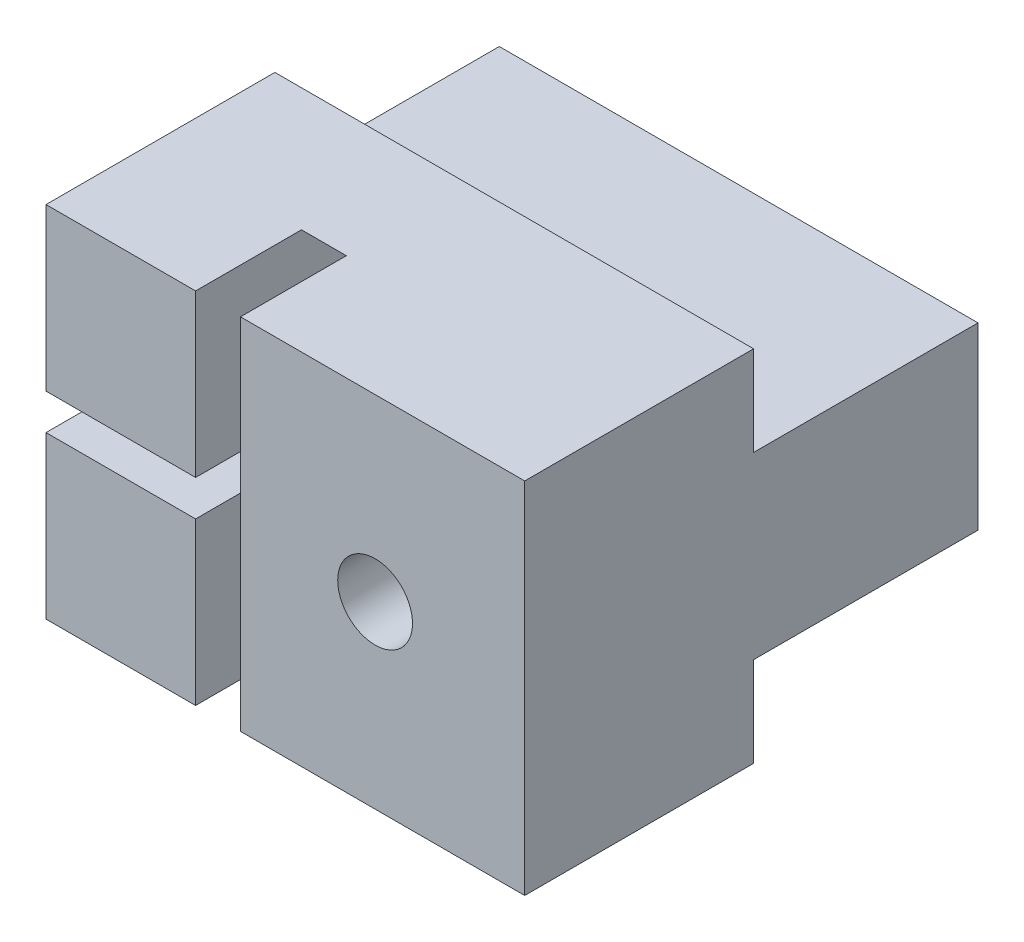
ISO-10303-21;
HEADER;
FILE_DESCRIPTION(('STEP AP214'),'2;1');
FILE_NAME('part.step','',(''),(''),'','','');
FILE_SCHEMA(('AUTOMOTIVE_DESIGN { 1 0 10303 214 1 1 1 1 }'));
ENDSEC;
DATA;
#1=APPLICATION_CONTEXT('core data for automotive mechanical design processes');
#2=APPLICATION_PROTOCOL_DEFINITION('international standard','automotive_design',2000,#1);
#3=PRODUCT_CONTEXT('',#1,'mechanical');
#4=PRODUCT('Part','Part','',(#3));
#5=PRODUCT_RELATED_PRODUCT_CATEGORY('part','',(#4));
#6=PRODUCT_DEFINITION_FORMATION('','',#4);
#7=PRODUCT_DEFINITION_CONTEXT('part definition',#1,'design');
#8=PRODUCT_DEFINITION('design','',#6,#7);
#9=PRODUCT_DEFINITION_SHAPE('','',#8);
#10=(LENGTH_UNIT() NAMED_UNIT(*) SI_UNIT(.MILLI.,.METRE.));
#11=(NAMED_UNIT(*) PLANE_ANGLE_UNIT() SI_UNIT($,.RADIAN.));
#12=(NAMED_UNIT(*) SI_UNIT($,.STERADIAN.) SOLID_ANGLE_UNIT());
#13=UNCERTAINTY_MEASURE_WITH_UNIT(LENGTH_MEASURE(1.E-05),#10,'distance_accuracy_value','');
#14=(GEOMETRIC_REPRESENTATION_CONTEXT(3) GLOBAL_UNCERTAINTY_ASSIGNED_CONTEXT((#13)) GLOBAL_UNIT_ASSIGNED_CONTEXT((#10,
#11,#12)) REPRESENTATION_CONTEXT('',''));
#15=CARTESIAN_POINT('',(0.,0.,0.));
#16=DIRECTION('',(0.,0.,1.));
#17=DIRECTION('',(1.,0.,0.));
#18=AXIS2_PLACEMENT_3D('',#15,#16,#17);
#19=CARTESIAN_POINT('',(0.,0.,0.));
#20=DIRECTION('',(0.,0.,-1.));
#21=DIRECTION('',(-1.,0.,0.));
#22=AXIS2_PLACEMENT_3D('',#19,#20,#21);
#23=PLANE('',#22);
#24=DIRECTION('',(1.,0.,0.));
#25=VECTOR('',#24,1.);
#26=CARTESIAN_POINT('',(-5.59969369608177,28.,0.));
#27=LINE('',#26,#25);
#28=CARTESIAN_POINT('',(-21.5996936960818,28.,0.));
#29=VERTEX_POINT('',#28);
#30=CARTESIAN_POINT('',(-5.59969369608177,28.,0.));
#31=VERTEX_POINT('',#30);
#32=EDGE_CURVE('E181',#29,#31,#27,.T.);
#33=ORIENTED_EDGE('',*,*,#32,.F.);
#34=DIRECTION('',(0.,-1.,0.));
#35=VECTOR('',#34,1.);
#36=CARTESIAN_POINT('',(-21.5996936960818,19.,0.));
#37=LINE('',#36,#35);
#38=CARTESIAN_POINT('',(-21.5996936960818,31.,0.));
#39=VERTEX_POINT('',#38);
#40=EDGE_CURVE('E275',#39,#29,#37,.T.);
#41=ORIENTED_EDGE('',*,*,#40,.F.);
#42=DIRECTION('',(-1.,0.,0.));
#43=VECTOR('',#42,1.);
#44=CARTESIAN_POINT('',(-21.5996936960818,31.,0.));
#45=LINE('',#44,#43);
#46=CARTESIAN_POINT('',(-5.59969369608177,31.,0.));
#47=VERTEX_POINT('',#46);
#48=EDGE_CURVE('E261',#47,#39,#45,.T.);
#49=ORIENTED_EDGE('',*,*,#48,.F.);
#50=DIRECTION('',(0.,1.,0.));
#51=VECTOR('',#50,1.);
#52=CARTESIAN_POINT('',(-5.59969369608177,19.,0.));
#53=LINE('',#52,#51);
#54=EDGE_CURVE('E61',#31,#47,#53,.T.);
#55=ORIENTED_EDGE('',*,*,#54,.F.);
#56=EDGE_LOOP('',(#33,#41,#49,#55));
#57=FACE_BOUND('',#56,.T.);
#58=ADVANCED_FACE('F45',(#57),#23,.T.);
#59=CARTESIAN_POINT('',(-21.5996936960818,19.,27.65));
#60=DIRECTION('',(0.,1.,0.));
#61=DIRECTION('',(0.,0.,1.));
#62=AXIS2_PLACEMENT_3D('',#59,#60,#61);
#63=PLANE('',#62);
#64=DIRECTION('',(0.,0.,1.));
#65=VECTOR('',#64,1.);
#66=CARTESIAN_POINT('',(-15.0996936960818,19.,27.65));
#67=LINE('',#66,#65);
#68=CARTESIAN_POINT('',(-15.0996936960818,19.,4.11123412892984));
#69=VERTEX_POINT('',#68);
#70=CARTESIAN_POINT('',(-15.0996936960818,19.,7.65));
#71=VERTEX_POINT('',#70);
#72=EDGE_CURVE('E216',#69,#71,#67,.T.);
#73=ORIENTED_EDGE('',*,*,#72,.F.);
#74=DIRECTION('',(-1.,0.,0.));
#75=VECTOR('',#74,1.);
#76=CARTESIAN_POINT('',(-15.0996936960818,19.,4.11123412892984));
#77=LINE('',#76,#75);
#78=CARTESIAN_POINT('',(-16.5996936960818,19.,4.11123412892984));
#79=VERTEX_POINT('',#78);
#80=EDGE_CURVE('E219',#69,#79,#77,.T.);
#81=ORIENTED_EDGE('',*,*,#80,.T.);
#82=DIRECTION('',(0.,0.,1.));
#83=VECTOR('',#82,1.);
#84=CARTESIAN_POINT('',(-16.5996936960818,19.,27.65));
#85=LINE('',#84,#83);
#86=CARTESIAN_POINT('',(-16.5996936960818,19.,7.65));
#87=VERTEX_POINT('',#86);
#88=EDGE_CURVE('E204',#79,#87,#85,.T.);
#89=ORIENTED_EDGE('',*,*,#88,.T.);
#90=DIRECTION('',(1.,0.,0.));
#91=VECTOR('',#90,1.);
#92=CARTESIAN_POINT('',(-21.5996936960818,19.,7.65));
#93=LINE('',#92,#91);
#94=CARTESIAN_POINT('',(-21.5996936960818,19.,7.65));
#95=VERTEX_POINT('',#94);
#96=EDGE_CURVE('E284',#95,#87,#93,.T.);
#97=ORIENTED_EDGE('',*,*,#96,.F.);
#98=DIRECTION('',(0.,0.,-1.));
#99=VECTOR('',#98,1.);
#100=CARTESIAN_POINT('',(-21.5996936960818,19.,27.65));
#101=LINE('',#100,#99);
#102=CARTESIAN_POINT('',(-21.5996936960818,19.,0.));
#103=VERTEX_POINT('',#102);
#104=EDGE_CURVE('E274',#95,#103,#101,.T.);
#105=ORIENTED_EDGE('',*,*,#104,.T.);
#106=DIRECTION('',(1.,0.,0.));
#107=VECTOR('',#106,1.);
#108=CARTESIAN_POINT('',(-21.5996936960818,19.,0.));
#109=LINE('',#108,#107);
#110=CARTESIAN_POINT('',(-5.59969369608177,19.,0.));
#111=VERTEX_POINT('',#110);
#112=EDGE_CURVE('E269',#103,#111,#109,.T.);
#113=ORIENTED_EDGE('',*,*,#112,.T.);
#114=DIRECTION('',(0.,0.,-1.));
#115=VECTOR('',#114,1.);
#116=CARTESIAN_POINT('',(-5.59969369608177,19.,27.65));
#117=LINE('',#116,#115);
#118=CARTESIAN_POINT('',(-5.59969369608177,19.,7.65));
#119=VERTEX_POINT('',#118);
#120=EDGE_CURVE('E273',#119,#111,#117,.T.);
#121=ORIENTED_EDGE('',*,*,#120,.F.);
#122=EDGE_CURVE('E288',#71,#119,#93,.T.);
#123=ORIENTED_EDGE('',*,*,#122,.F.);
#124=EDGE_LOOP('',(#73,#81,#89,#97,#105,#113,#121,#123));
#125=FACE_BOUND('',#124,.T.);
#126=ADVANCED_FACE('F318',(#125),#63,.F.);
#127=CARTESIAN_POINT('',(-21.5996936960818,31.,27.65));
#128=DIRECTION('',(0.,-1.,0.));
#129=DIRECTION('',(0.,0.,-1.));
#130=AXIS2_PLACEMENT_3D('',#127,#128,#129);
#131=PLANE('',#130);
#132=DIRECTION('',(0.,0.,-1.));
#133=VECTOR('',#132,1.);
#134=CARTESIAN_POINT('',(-15.0996936960818,31.,27.65));
#135=LINE('',#134,#133);
#136=CARTESIAN_POINT('',(-15.0996936960818,31.,7.65));
#137=VERTEX_POINT('',#136);
#138=CARTESIAN_POINT('',(-15.0996936960818,31.,4.11123412892984));
#139=VERTEX_POINT('',#138);
#140=EDGE_CURVE('E213',#137,#139,#135,.T.);
#141=ORIENTED_EDGE('',*,*,#140,.F.);
#142=DIRECTION('',(-1.,0.,0.));
#143=VECTOR('',#142,1.);
#144=CARTESIAN_POINT('',(-21.5996936960818,31.,7.65));
#145=LINE('',#144,#143);
#146=CARTESIAN_POINT('',(-5.59969369608177,31.,7.65));
#147=VERTEX_POINT('',#146);
#148=EDGE_CURVE('E294',#147,#137,#145,.T.);
#149=ORIENTED_EDGE('',*,*,#148,.F.);
#150=DIRECTION('',(0.,0.,-1.));
#151=VECTOR('',#150,1.);
#152=CARTESIAN_POINT('',(-5.59969369608177,31.,27.65));
#153=LINE('',#152,#151);
#154=EDGE_CURVE('E266',#147,#47,#153,.T.);
#155=ORIENTED_EDGE('',*,*,#154,.T.);
#156=ORIENTED_EDGE('',*,*,#48,.T.);
#157=DIRECTION('',(0.,0.,-1.));
#158=VECTOR('',#157,1.);
#159=CARTESIAN_POINT('',(-21.5996936960818,31.,27.65));
#160=LINE('',#159,#158);
#161=CARTESIAN_POINT('',(-21.5996936960818,31.,7.65));
#162=VERTEX_POINT('',#161);
#163=EDGE_CURVE('E251',#162,#39,#160,.T.);
#164=ORIENTED_EDGE('',*,*,#163,.F.);
#165=CARTESIAN_POINT('',(-16.5996936960818,31.,7.65));
#166=VERTEX_POINT('',#165);
#167=EDGE_CURVE('E265',#166,#162,#145,.T.);
#168=ORIENTED_EDGE('',*,*,#167,.F.);
#169=DIRECTION('',(0.,0.,-1.));
#170=VECTOR('',#169,1.);
#171=CARTESIAN_POINT('',(-16.5996936960818,31.,27.65));
#172=LINE('',#171,#170);
#173=CARTESIAN_POINT('',(-16.5996936960818,31.,4.11123412892984));
#174=VERTEX_POINT('',#173);
#175=EDGE_CURVE('E209',#166,#174,#172,.T.);
#176=ORIENTED_EDGE('',*,*,#175,.T.);
#177=DIRECTION('',(-1.,0.,0.));
#178=VECTOR('',#177,1.);
#179=CARTESIAN_POINT('',(-15.0996936960818,31.,4.11123412892984));
#180=LINE('',#179,#178);
#181=EDGE_CURVE('E11',#174,#139,#180,.F.);
#182=ORIENTED_EDGE('',*,*,#181,.T.);
#183=EDGE_LOOP('',(#141,#149,#155,#156,#164,#168,#176,#182));
#184=FACE_BOUND('',#183,.T.);
#185=ADVANCED_FACE('F373',(#184),#131,.F.);
#186=CARTESIAN_POINT('',(-94.7383382518,25.35,7.65));
#187=DIRECTION('',(0.,0.,1.));
#188=DIRECTION('',(0.,1.,0.));
#189=AXIS2_PLACEMENT_3D('',#186,#187,#188);
#190=PLANE('',#189);
#191=CARTESIAN_POINT('',(-10.5996936960818,25.,7.65));
#192=DIRECTION('',(0.,0.,-1.));
#193=DIRECTION('',(-1.,0.,0.));
#194=AXIS2_PLACEMENT_3D('',#191,#192,#193);
#195=CIRCLE('',#194,1.25);
#196=CARTESIAN_POINT('',(-11.8496936960818,25.,7.65));
#197=VERTEX_POINT('',#196);
#198=EDGE_CURVE('E406',#197,#197,#195,.T.);
#199=ORIENTED_EDGE('',*,*,#198,.T.);
#200=EDGE_LOOP('',(#199));
#201=FACE_BOUND('',#200,.T.);
#202=ORIENTED_EDGE('',*,*,#148,.T.);
#203=DIRECTION('',(0.,-1.,0.));
#204=VECTOR('',#203,1.);
#205=CARTESIAN_POINT('',(-15.0996936960818,25.35,7.65));
#206=LINE('',#205,#204);
#207=EDGE_CURVE('E54',#137,#71,#206,.T.);
#208=ORIENTED_EDGE('',*,*,#207,.T.);
#209=ORIENTED_EDGE('',*,*,#122,.T.);
#210=DIRECTION('',(0.,1.,0.));
#211=VECTOR('',#210,1.);
#212=CARTESIAN_POINT('',(-5.59969369608177,19.,7.65));
#213=LINE('',#212,#211);
#214=EDGE_CURVE('E280',#119,#147,#213,.T.);
#215=ORIENTED_EDGE('',*,*,#214,.T.);
#216=EDGE_LOOP('',(#202,#208,#209,#215));
#217=FACE_BOUND('',#216,.T.);
#218=ADVANCED_FACE('F311',(#201,#217),#190,.T.);
#219=DIRECTION('',(0.,-1.,0.));
#220=VECTOR('',#219,1.);
#221=CARTESIAN_POINT('',(-16.5996936960818,25.35,7.65));
#222=LINE('',#221,#220);
#223=CARTESIAN_POINT('',(-16.5996936960818,25.6,7.65));
#224=VERTEX_POINT('',#223);
#225=EDGE_CURVE('E205',#166,#224,#222,.T.);
#226=ORIENTED_EDGE('',*,*,#225,.F.);
#227=ORIENTED_EDGE('',*,*,#167,.T.);
#228=DIRECTION('',(0.,-1.,0.));
#229=VECTOR('',#228,1.);
#230=CARTESIAN_POINT('',(-21.5996936960818,19.,7.65));
#231=LINE('',#230,#229);
#232=CARTESIAN_POINT('',(-21.5996936960818,25.6,7.65));
#233=VERTEX_POINT('',#232);
#234=EDGE_CURVE('E289',#162,#233,#231,.T.);
#235=ORIENTED_EDGE('',*,*,#234,.T.);
#236=DIRECTION('',(-1.,0.,0.));
#237=VECTOR('',#236,1.);
#238=CARTESIAN_POINT('',(-21.5996936960818,25.6,7.65));
#239=LINE('',#238,#237);
#240=EDGE_CURVE('E229',#224,#233,#239,.T.);
#241=ORIENTED_EDGE('',*,*,#240,.F.);
#242=EDGE_LOOP('',(#226,#227,#235,#241));
#243=FACE_BOUND('',#242,.T.);
#244=ADVANCED_FACE('F335',(#243),#190,.T.);
#245=CARTESIAN_POINT('',(-21.5996936960818,19.,27.65));
#246=DIRECTION('',(1.,0.,0.));
#247=DIRECTION('',(0.,0.,-1.));
#248=AXIS2_PLACEMENT_3D('',#245,#246,#247);
#249=PLANE('',#248);
#250=DIRECTION('',(0.,-1.,0.));
#251=VECTOR('',#250,1.);
#252=CARTESIAN_POINT('',(-21.5996936960818,25.6,3.15));
#253=LINE('',#252,#251);
#254=CARTESIAN_POINT('',(-21.5996936960818,25.6,3.15));
#255=VERTEX_POINT('',#254);
#256=CARTESIAN_POINT('',(-21.5996936960818,24.4,3.15));
#257=VERTEX_POINT('',#256);
#258=EDGE_CURVE('E224',#255,#257,#253,.T.);
#259=ORIENTED_EDGE('',*,*,#258,.F.);
#260=DIRECTION('',(0.,0.,1.));
#261=VECTOR('',#260,1.);
#262=CARTESIAN_POINT('',(-21.5996936960818,25.6,3.15));
#263=LINE('',#262,#261);
#264=EDGE_CURVE('E247',#255,#233,#263,.T.);
#265=ORIENTED_EDGE('',*,*,#264,.T.);
#266=ORIENTED_EDGE('',*,*,#234,.F.);
#267=ORIENTED_EDGE('',*,*,#163,.T.);
#268=ORIENTED_EDGE('',*,*,#40,.T.);
#269=DIRECTION('',(0.,0.,1.));
#270=VECTOR('',#269,1.);
#271=CARTESIAN_POINT('',(-21.5996936960818,28.,-7.5));
#272=LINE('',#271,#270);
#273=CARTESIAN_POINT('',(-21.5996936960818,28.,-7.5));
#274=VERTEX_POINT('',#273);
#275=EDGE_CURVE('E194',#274,#29,#272,.T.);
#276=ORIENTED_EDGE('',*,*,#275,.F.);
#277=DIRECTION('',(0.,1.,0.));
#278=VECTOR('',#277,1.);
#279=CARTESIAN_POINT('',(-21.5996936960818,28.,-7.5));
#280=LINE('',#279,#278);
#281=CARTESIAN_POINT('',(-21.5996936960818,22.,-7.5));
#282=VERTEX_POINT('',#281);
#283=EDGE_CURVE('E170',#282,#274,#280,.T.);
#284=ORIENTED_EDGE('',*,*,#283,.F.);
#285=DIRECTION('',(0.,0.,1.));
#286=VECTOR('',#285,1.);
#287=CARTESIAN_POINT('',(-21.5996936960818,22.,-7.5));
#288=LINE('',#287,#286);
#289=CARTESIAN_POINT('',(-21.5996936960818,22.,0.));
#290=VERTEX_POINT('',#289);
#291=EDGE_CURVE('E166',#282,#290,#288,.T.);
#292=ORIENTED_EDGE('',*,*,#291,.T.);
#293=EDGE_CURVE('E279',#290,#103,#37,.T.);
#294=ORIENTED_EDGE('',*,*,#293,.T.);
#295=ORIENTED_EDGE('',*,*,#104,.F.);
#296=CARTESIAN_POINT('',(-21.5996936960818,24.4,7.65));
#297=VERTEX_POINT('',#296);
#298=EDGE_CURVE('E293',#297,#95,#231,.T.);
#299=ORIENTED_EDGE('',*,*,#298,.F.);
#300=DIRECTION('',(0.,0.,1.));
#301=VECTOR('',#300,1.);
#302=CARTESIAN_POINT('',(-21.5996936960818,24.4,3.15));
#303=LINE('',#302,#301);
#304=EDGE_CURVE('E241',#257,#297,#303,.T.);
#305=ORIENTED_EDGE('',*,*,#304,.F.);
#306=EDGE_LOOP('',(#259,#265,#266,#267,#268,#276,#284,#292,#294,#295,#299,#305));
#307=FACE_BOUND('',#306,.T.);
#308=ADVANCED_FACE('F340',(#307),#249,.F.);
#309=CARTESIAN_POINT('',(-5.59969369608177,19.,27.65));
#310=DIRECTION('',(-1.,0.,0.));
#311=DIRECTION('',(0.,0.,1.));
#312=AXIS2_PLACEMENT_3D('',#309,#310,#311);
#313=PLANE('',#312);
#314=ORIENTED_EDGE('',*,*,#214,.F.);
#315=ORIENTED_EDGE('',*,*,#120,.T.);
#316=CARTESIAN_POINT('',(-5.59969369608177,22.,0.));
#317=VERTEX_POINT('',#316);
#318=EDGE_CURVE('E185',#111,#317,#53,.T.);
#319=ORIENTED_EDGE('',*,*,#318,.T.);
#320=DIRECTION('',(0.,0.,1.));
#321=VECTOR('',#320,1.);
#322=CARTESIAN_POINT('',(-5.59969369608178,22.,-7.5));
#323=LINE('',#322,#321);
#324=CARTESIAN_POINT('',(-5.59969369608178,22.,-7.5));
#325=VERTEX_POINT('',#324);
#326=EDGE_CURVE('E164',#325,#317,#323,.T.);
#327=ORIENTED_EDGE('',*,*,#326,.F.);
#328=DIRECTION('',(0.,-1.,0.));
#329=VECTOR('',#328,1.);
#330=CARTESIAN_POINT('',(-5.59969369608177,28.,-7.5));
#331=LINE('',#330,#329);
#332=CARTESIAN_POINT('',(-5.59969369608177,28.,-7.5));
#333=VERTEX_POINT('',#332);
#334=EDGE_CURVE('E171',#333,#325,#331,.T.);
#335=ORIENTED_EDGE('',*,*,#334,.F.);
#336=DIRECTION('',(0.,0.,1.));
#337=VECTOR('',#336,1.);
#338=CARTESIAN_POINT('',(-5.59969369608177,28.,-7.5));
#339=LINE('',#338,#337);
#340=EDGE_CURVE('E363',#333,#31,#339,.T.);
#341=ORIENTED_EDGE('',*,*,#340,.T.);
#342=ORIENTED_EDGE('',*,*,#54,.T.);
#343=ORIENTED_EDGE('',*,*,#154,.F.);
#344=EDGE_LOOP('',(#314,#315,#319,#327,#335,#341,#342,#343));
#345=FACE_BOUND('',#344,.T.);
#346=ADVANCED_FACE('F184',(#345),#313,.F.);
#347=DIRECTION('',(-1.,0.,0.));
#348=VECTOR('',#347,1.);
#349=CARTESIAN_POINT('',(-5.59969369608178,22.,0.));
#350=LINE('',#349,#348);
#351=EDGE_CURVE('E69',#317,#290,#350,.T.);
#352=ORIENTED_EDGE('',*,*,#351,.F.);
#353=ORIENTED_EDGE('',*,*,#318,.F.);
#354=ORIENTED_EDGE('',*,*,#112,.F.);
#355=ORIENTED_EDGE('',*,*,#293,.F.);
#356=EDGE_LOOP('',(#352,#353,#354,#355));
#357=FACE_BOUND('',#356,.T.);
#358=ADVANCED_FACE('F354',(#357),#23,.T.);
#359=CARTESIAN_POINT('',(-16.5996936960818,24.4,7.65));
#360=VERTEX_POINT('',#359);
#361=EDGE_CURVE('E200',#360,#87,#222,.T.);
#362=ORIENTED_EDGE('',*,*,#361,.F.);
#363=DIRECTION('',(1.,0.,0.));
#364=VECTOR('',#363,1.);
#365=CARTESIAN_POINT('',(-21.5996936960818,24.4,7.65));
#366=LINE('',#365,#364);
#367=EDGE_CURVE('E223',#297,#360,#366,.T.);
#368=ORIENTED_EDGE('',*,*,#367,.F.);
#369=ORIENTED_EDGE('',*,*,#298,.T.);
#370=ORIENTED_EDGE('',*,*,#96,.T.);
#371=EDGE_LOOP('',(#362,#368,#369,#370));
#372=FACE_BOUND('',#371,.T.);
#373=ADVANCED_FACE('F47',(#372),#190,.T.);
#374=CARTESIAN_POINT('',(-21.5996936960818,25.6,3.15));
#375=DIRECTION('',(0.,1.,0.));
#376=DIRECTION('',(0.,0.,1.));
#377=AXIS2_PLACEMENT_3D('',#374,#375,#376);
#378=PLANE('',#377);
#379=ORIENTED_EDGE('',*,*,#240,.T.);
#380=ORIENTED_EDGE('',*,*,#264,.F.);
#381=DIRECTION('',(-1.,0.,0.));
#382=VECTOR('',#381,1.);
#383=CARTESIAN_POINT('',(-21.5996936960818,25.6,3.15));
#384=LINE('',#383,#382);
#385=CARTESIAN_POINT('',(-16.5996936960818,25.6,3.15));
#386=VERTEX_POINT('',#385);
#387=EDGE_CURVE('E237',#386,#255,#384,.T.);
#388=ORIENTED_EDGE('',*,*,#387,.F.);
#389=DIRECTION('',(0.,0.,1.));
#390=VECTOR('',#389,1.);
#391=CARTESIAN_POINT('',(-16.5996936960818,25.6,3.15));
#392=LINE('',#391,#390);
#393=EDGE_CURVE('E252',#386,#224,#392,.T.);
#394=ORIENTED_EDGE('',*,*,#393,.T.);
#395=EDGE_LOOP('',(#379,#380,#388,#394));
#396=FACE_BOUND('',#395,.T.);
#397=ADVANCED_FACE('F334',(#396),#378,.F.);
#398=CARTESIAN_POINT('',(-21.5996936960818,24.4,3.15));
#399=DIRECTION('',(0.,-1.,0.));
#400=DIRECTION('',(0.,0.,-1.));
#401=AXIS2_PLACEMENT_3D('',#398,#399,#400);
#402=PLANE('',#401);
#403=ORIENTED_EDGE('',*,*,#367,.T.);
#404=DIRECTION('',(0.,0.,1.));
#405=VECTOR('',#404,1.);
#406=CARTESIAN_POINT('',(-16.5996936960818,24.4,3.15));
#407=LINE('',#406,#405);
#408=CARTESIAN_POINT('',(-16.5996936960818,24.4,3.15));
#409=VERTEX_POINT('',#408);
#410=EDGE_CURVE('E256',#409,#360,#407,.T.);
#411=ORIENTED_EDGE('',*,*,#410,.F.);
#412=DIRECTION('',(1.,0.,0.));
#413=VECTOR('',#412,1.);
#414=CARTESIAN_POINT('',(-21.5996936960818,24.4,3.15));
#415=LINE('',#414,#413);
#416=EDGE_CURVE('E228',#257,#409,#415,.T.);
#417=ORIENTED_EDGE('',*,*,#416,.F.);
#418=ORIENTED_EDGE('',*,*,#304,.T.);
#419=EDGE_LOOP('',(#403,#411,#417,#418));
#420=FACE_BOUND('',#419,.T.);
#421=ADVANCED_FACE('F347',(#420),#402,.F.);
#422=CARTESIAN_POINT('',(0.,0.,3.15));
#423=DIRECTION('',(0.,0.,1.));
#424=DIRECTION('',(1.,0.,0.));
#425=AXIS2_PLACEMENT_3D('',#422,#423,#424);
#426=PLANE('',#425);
#427=ORIENTED_EDGE('',*,*,#258,.T.);
#428=ORIENTED_EDGE('',*,*,#416,.T.);
#429=DIRECTION('',(0.,1.,0.));
#430=VECTOR('',#429,1.);
#431=CARTESIAN_POINT('',(-16.5996936960818,25.6,3.15));
#432=LINE('',#431,#430);
#433=EDGE_CURVE('E233',#409,#386,#432,.T.);
#434=ORIENTED_EDGE('',*,*,#433,.T.);
#435=ORIENTED_EDGE('',*,*,#387,.T.);
#436=EDGE_LOOP('',(#427,#428,#434,#435));
#437=FACE_BOUND('',#436,.T.);
#438=ADVANCED_FACE('F343',(#437),#426,.T.);
#439=CARTESIAN_POINT('',(-15.0996936960818,25.,8.));
#440=DIRECTION('',(-1.,0.,0.));
#441=DIRECTION('',(0.,0.,1.));
#442=AXIS2_PLACEMENT_3D('',#439,#440,#441);
#443=CYLINDRICAL_SURFACE('',#442,7.15);
#444=CARTESIAN_POINT('',(-15.0996936960818,25.,8.));
#445=DIRECTION('',(-1.,0.,0.));
#446=DIRECTION('',(0.,0.,1.));
#447=AXIS2_PLACEMENT_3D('',#444,#445,#446);
#448=CIRCLE('',#447,7.15);
#449=EDGE_CURVE('E192',#139,#69,#448,.T.);
#450=ORIENTED_EDGE('',*,*,#449,.F.);
#451=ORIENTED_EDGE('',*,*,#181,.F.);
#452=CARTESIAN_POINT('',(-16.5996936960818,25.,8.));
#453=DIRECTION('',(-1.,0.,0.));
#454=DIRECTION('',(0.,0.,1.));
#455=AXIS2_PLACEMENT_3D('',#452,#453,#454);
#456=CIRCLE('',#455,7.15);
#457=EDGE_CURVE('E187',#174,#79,#456,.T.);
#458=ORIENTED_EDGE('',*,*,#457,.T.);
#459=ORIENTED_EDGE('',*,*,#80,.F.);
#460=EDGE_LOOP('',(#450,#451,#458,#459));
#461=FACE_BOUND('',#460,.T.);
#462=ADVANCED_FACE('F446',(#461),#443,.F.);
#463=CARTESIAN_POINT('',(-15.0996936960818,25.,8.));
#464=DIRECTION('',(-1.,0.,0.));
#465=DIRECTION('',(0.,0.,1.));
#466=AXIS2_PLACEMENT_3D('',#463,#464,#465);
#467=PLANE('',#466);
#468=ORIENTED_EDGE('',*,*,#72,.T.);
#469=ORIENTED_EDGE('',*,*,#207,.F.);
#470=ORIENTED_EDGE('',*,*,#140,.T.);
#471=ORIENTED_EDGE('',*,*,#449,.T.);
#472=EDGE_LOOP('',(#468,#469,#470,#471));
#473=FACE_BOUND('',#472,.T.);
#474=ADVANCED_FACE('F443',(#473),#467,.T.);
#475=CARTESIAN_POINT('',(-16.5996936960818,25.,8.));
#476=DIRECTION('',(-1.,0.,0.));
#477=DIRECTION('',(0.,0.,1.));
#478=AXIS2_PLACEMENT_3D('',#475,#476,#477);
#479=PLANE('',#478);
#480=ORIENTED_EDGE('',*,*,#225,.T.);
#481=ORIENTED_EDGE('',*,*,#393,.F.);
#482=ORIENTED_EDGE('',*,*,#433,.F.);
#483=ORIENTED_EDGE('',*,*,#410,.T.);
#484=ORIENTED_EDGE('',*,*,#361,.T.);
#485=ORIENTED_EDGE('',*,*,#88,.F.);
#486=ORIENTED_EDGE('',*,*,#457,.F.);
#487=ORIENTED_EDGE('',*,*,#175,.F.);
#488=EDGE_LOOP('',(#480,#481,#482,#483,#484,#485,#486,#487));
#489=FACE_BOUND('',#488,.T.);
#490=ADVANCED_FACE('F327',(#489),#479,.F.);
#491=CARTESIAN_POINT('',(-5.59969369608178,22.,-7.5));
#492=DIRECTION('',(0.,1.,0.));
#493=DIRECTION('',(0.,0.,1.));
#494=AXIS2_PLACEMENT_3D('',#491,#492,#493);
#495=PLANE('',#494);
#496=ORIENTED_EDGE('',*,*,#351,.T.);
#497=ORIENTED_EDGE('',*,*,#291,.F.);
#498=DIRECTION('',(-1.,0.,0.));
#499=VECTOR('',#498,1.);
#500=CARTESIAN_POINT('',(-5.59969369608178,22.,-7.5));
#501=LINE('',#500,#499);
#502=EDGE_CURVE('E160',#325,#282,#501,.T.);
#503=ORIENTED_EDGE('',*,*,#502,.F.);
#504=ORIENTED_EDGE('',*,*,#326,.T.);
#505=EDGE_LOOP('',(#496,#497,#503,#504));
#506=FACE_BOUND('',#505,.T.);
#507=ADVANCED_FACE('F162',(#506),#495,.F.);
#508=CARTESIAN_POINT('',(-5.59969369608177,28.,-7.5));
#509=DIRECTION('',(0.,-1.,0.));
#510=DIRECTION('',(0.,0.,-1.));
#511=AXIS2_PLACEMENT_3D('',#508,#509,#510);
#512=PLANE('',#511);
#513=ORIENTED_EDGE('',*,*,#32,.T.);
#514=ORIENTED_EDGE('',*,*,#340,.F.);
#515=DIRECTION('',(1.,0.,0.));
#516=VECTOR('',#515,1.);
#517=CARTESIAN_POINT('',(-5.59969369608177,28.,-7.5));
#518=LINE('',#517,#516);
#519=EDGE_CURVE('E176',#274,#333,#518,.T.);
#520=ORIENTED_EDGE('',*,*,#519,.F.);
#521=ORIENTED_EDGE('',*,*,#275,.T.);
#522=EDGE_LOOP('',(#513,#514,#520,#521));
#523=FACE_BOUND('',#522,.T.);
#524=ADVANCED_FACE('F371',(#523),#512,.F.);
#525=CARTESIAN_POINT('',(0.,0.,-7.5));
#526=DIRECTION('',(0.,0.,-1.));
#527=DIRECTION('',(-1.,0.,0.));
#528=AXIS2_PLACEMENT_3D('',#525,#526,#527);
#529=PLANE('',#528);
#530=CARTESIAN_POINT('',(-10.5996936960818,25.,-7.5));
#531=DIRECTION('',(0.,0.,-1.));
#532=DIRECTION('',(-1.,0.,0.));
#533=AXIS2_PLACEMENT_3D('',#530,#531,#532);
#534=CIRCLE('',#533,2.25);
#535=CARTESIAN_POINT('',(-12.8496936960818,25.,-7.5));
#536=VERTEX_POINT('',#535);
#537=EDGE_CURVE('E409',#536,#536,#534,.T.);
#538=ORIENTED_EDGE('',*,*,#537,.F.);
#539=EDGE_LOOP('',(#538));
#540=FACE_BOUND('',#539,.T.);
#541=ORIENTED_EDGE('',*,*,#334,.T.);
#542=ORIENTED_EDGE('',*,*,#502,.T.);
#543=ORIENTED_EDGE('',*,*,#283,.T.);
#544=ORIENTED_EDGE('',*,*,#519,.T.);
#545=EDGE_LOOP('',(#541,#542,#543,#544));
#546=FACE_BOUND('',#545,.T.);
#547=ADVANCED_FACE('F174',(#540,#546),#529,.T.);
#548=CARTESIAN_POINT('',(-10.5996936960818,25.,6.36396103067893));
#549=DIRECTION('',(0.,0.,-1.));
#550=DIRECTION('',(-1.,0.,0.));
#551=AXIS2_PLACEMENT_3D('',#548,#549,#550);
#552=CYLINDRICAL_SURFACE('',#551,2.25);
#553=CARTESIAN_POINT('',(-10.5996936960818,25.,0.));
#554=DIRECTION('',(0.,0.,-1.));
#555=DIRECTION('',(-1.,0.,0.));
#556=AXIS2_PLACEMENT_3D('',#553,#554,#555);
#557=CIRCLE('',#556,2.25);
#558=CARTESIAN_POINT('',(-12.8496936960818,25.,0.));
#559=VERTEX_POINT('',#558);
#560=EDGE_CURVE('E356',#559,#559,#557,.F.);
#561=ORIENTED_EDGE('',*,*,#560,.T.);
#562=EDGE_LOOP('',(#561));
#563=FACE_BOUND('',#562,.T.);
#564=ORIENTED_EDGE('',*,*,#537,.T.);
#565=EDGE_LOOP('',(#564));
#566=FACE_BOUND('',#565,.T.);
#567=ADVANCED_FACE('F423',(#563,#566),#552,.F.);
#568=CARTESIAN_POINT('',(0.,0.,0.));
#569=DIRECTION('',(0.,0.,-1.));
#570=DIRECTION('',(-1.,0.,0.));
#571=AXIS2_PLACEMENT_3D('',#568,#569,#570);
#572=PLANE('',#571);
#573=CARTESIAN_POINT('',(-10.5996936960818,25.,0.));
#574=DIRECTION('',(0.,0.,-1.));
#575=DIRECTION('',(-1.,0.,0.));
#576=AXIS2_PLACEMENT_3D('',#573,#574,#575);
#577=CIRCLE('',#576,1.25);
#578=CARTESIAN_POINT('',(-11.8496936960818,25.,0.));
#579=VERTEX_POINT('',#578);
#580=EDGE_CURVE('E410',#579,#579,#577,.T.);
#581=ORIENTED_EDGE('',*,*,#580,.F.);
#582=EDGE_LOOP('',(#581));
#583=FACE_BOUND('',#582,.T.);
#584=ORIENTED_EDGE('',*,*,#560,.F.);
#585=EDGE_LOOP('',(#584));
#586=FACE_BOUND('',#585,.T.);
#587=ADVANCED_FACE('F426',(#583,#586),#572,.T.);
#588=CARTESIAN_POINT('',(-10.5996936960818,25.,7.65));
#589=DIRECTION('',(0.,0.,-1.));
#590=DIRECTION('',(-1.,0.,0.));
#591=AXIS2_PLACEMENT_3D('',#588,#589,#590);
#592=CYLINDRICAL_SURFACE('',#591,1.25);
#593=ORIENTED_EDGE('',*,*,#198,.F.);
#594=EDGE_LOOP('',(#593));
#595=FACE_BOUND('',#594,.T.);
#596=ORIENTED_EDGE('',*,*,#580,.T.);
#597=EDGE_LOOP('',(#596));
#598=FACE_BOUND('',#597,.T.);
#599=ADVANCED_FACE('F427',(#595,#598),#592,.F.);
#600=CLOSED_SHELL('',(#58,#126,#185,#218,#244,#308,#346,#358,#373,#397,#421,#438,#462,#474,#490,
#507,#524,#547,#567,#587,#599));
#601=MANIFOLD_SOLID_BREP('B2',#600);
#602=ADVANCED_BREP_SHAPE_REPRESENTATION('',(#18,#601),#14);
#603=SHAPE_DEFINITION_REPRESENTATION(#9,#602);
ENDSEC;
END-ISO-10303-21;
